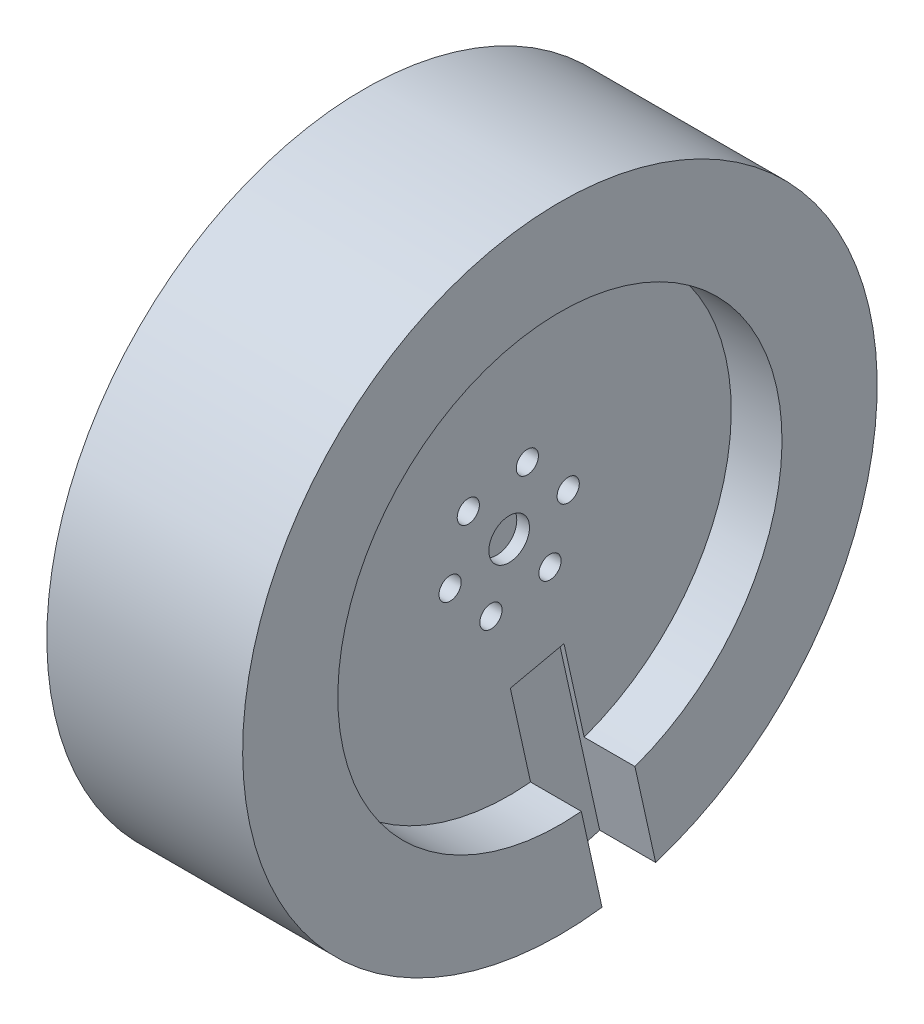
ISO-10303-21;
HEADER;
FILE_DESCRIPTION(('STEP AP214'),'2;1');
FILE_NAME('part.step','',(''),(''),'','','');
FILE_SCHEMA(('AUTOMOTIVE_DESIGN { 1 0 10303 214 1 1 1 1 }'));
ENDSEC;
DATA;
#1=APPLICATION_CONTEXT('core data for automotive mechanical design processes');
#2=APPLICATION_PROTOCOL_DEFINITION('international standard','automotive_design',2000,#1);
#3=PRODUCT_CONTEXT('',#1,'mechanical');
#4=PRODUCT('Part','Part','',(#3));
#5=PRODUCT_RELATED_PRODUCT_CATEGORY('part','',(#4));
#6=PRODUCT_DEFINITION_FORMATION('','',#4);
#7=PRODUCT_DEFINITION_CONTEXT('part definition',#1,'design');
#8=PRODUCT_DEFINITION('design','',#6,#7);
#9=PRODUCT_DEFINITION_SHAPE('','',#8);
#10=(LENGTH_UNIT() NAMED_UNIT(*) SI_UNIT(.MILLI.,.METRE.));
#11=(NAMED_UNIT(*) PLANE_ANGLE_UNIT() SI_UNIT($,.RADIAN.));
#12=(NAMED_UNIT(*) SI_UNIT($,.STERADIAN.) SOLID_ANGLE_UNIT());
#13=UNCERTAINTY_MEASURE_WITH_UNIT(LENGTH_MEASURE(1.E-05),#10,'distance_accuracy_value','');
#14=(GEOMETRIC_REPRESENTATION_CONTEXT(3) GLOBAL_UNCERTAINTY_ASSIGNED_CONTEXT((#13)) GLOBAL_UNIT_ASSIGNED_CONTEXT((#10,
#11,#12)) REPRESENTATION_CONTEXT('',''));
#15=CARTESIAN_POINT('',(0.,0.,0.));
#16=DIRECTION('',(0.,0.,1.));
#17=DIRECTION('',(1.,0.,0.));
#18=AXIS2_PLACEMENT_3D('',#15,#16,#17);
#19=CARTESIAN_POINT('',(30.,-9.0881194194578,2.86827220076371));
#20=DIRECTION('',(-1.,0.,0.));
#21=DIRECTION('',(0.,0.,1.));
#22=AXIS2_PLACEMENT_3D('',#19,#20,#21);
#23=CYLINDRICAL_SURFACE('',#22,1.75);
#24=CARTESIAN_POINT('',(22.86,-9.0881194194578,2.86827220076371));
#25=DIRECTION('',(1.,0.,0.));
#26=DIRECTION('',(0.,0.,-1.));
#27=AXIS2_PLACEMENT_3D('',#24,#25,#26);
#28=CIRCLE('',#27,1.75);
#29=CARTESIAN_POINT('',(22.86,-9.0881194194578,1.11827220076371));
#30=VERTEX_POINT('',#29);
#31=EDGE_CURVE('E145',#30,#30,#28,.T.);
#32=ORIENTED_EDGE('',*,*,#31,.T.);
#33=EDGE_LOOP('',(#32));
#34=FACE_BOUND('',#33,.T.);
#35=CARTESIAN_POINT('',(10.,-9.0881194194578,2.86827220076371));
#36=DIRECTION('',(-1.,0.,0.));
#37=DIRECTION('',(0.,0.,1.));
#38=AXIS2_PLACEMENT_3D('',#35,#36,#37);
#39=CIRCLE('',#38,1.75);
#40=CARTESIAN_POINT('',(10.,-9.0881194194578,4.61827220076371));
#41=VERTEX_POINT('',#40);
#42=EDGE_CURVE('E38',#41,#41,#39,.F.);
#43=ORIENTED_EDGE('',*,*,#42,.F.);
#44=EDGE_LOOP('',(#43));
#45=FACE_BOUND('',#44,.T.);
#46=ADVANCED_FACE('F34',(#34,#45),#23,.F.);
#47=CARTESIAN_POINT('',(30.,-2.06006311889883,9.30467839025899));
#48=DIRECTION('',(-1.,0.,0.));
#49=DIRECTION('',(0.,0.,1.));
#50=AXIS2_PLACEMENT_3D('',#47,#48,#49);
#51=CYLINDRICAL_SURFACE('',#50,1.75);
#52=CARTESIAN_POINT('',(22.86,-2.06006311889883,9.30467839025899));
#53=DIRECTION('',(1.,0.,0.));
#54=DIRECTION('',(0.,0.,-1.));
#55=AXIS2_PLACEMENT_3D('',#52,#53,#54);
#56=CIRCLE('',#55,1.75);
#57=CARTESIAN_POINT('',(22.86,-2.06006311889883,7.55467839025899));
#58=VERTEX_POINT('',#57);
#59=EDGE_CURVE('E149',#58,#58,#56,.T.);
#60=ORIENTED_EDGE('',*,*,#59,.T.);
#61=EDGE_LOOP('',(#60));
#62=FACE_BOUND('',#61,.T.);
#63=CARTESIAN_POINT('',(10.,-2.06006311889883,9.30467839025899));
#64=DIRECTION('',(-1.,0.,0.));
#65=DIRECTION('',(0.,0.,1.));
#66=AXIS2_PLACEMENT_3D('',#63,#64,#65);
#67=CIRCLE('',#66,1.75);
#68=CARTESIAN_POINT('',(10.,-2.06006311889883,11.054678390259));
#69=VERTEX_POINT('',#68);
#70=EDGE_CURVE('E176',#69,#69,#67,.F.);
#71=ORIENTED_EDGE('',*,*,#70,.F.);
#72=EDGE_LOOP('',(#71));
#73=FACE_BOUND('',#72,.T.);
#74=ADVANCED_FACE('F256',(#62,#73),#51,.F.);
#75=CARTESIAN_POINT('',(30.,7.02805630055897,6.43640618949528));
#76=DIRECTION('',(-1.,0.,0.));
#77=DIRECTION('',(0.,0.,1.));
#78=AXIS2_PLACEMENT_3D('',#75,#76,#77);
#79=CYLINDRICAL_SURFACE('',#78,1.75);
#80=CARTESIAN_POINT('',(22.86,7.02805630055897,6.43640618949528));
#81=DIRECTION('',(1.,0.,0.));
#82=DIRECTION('',(0.,0.,-1.));
#83=AXIS2_PLACEMENT_3D('',#80,#81,#82);
#84=CIRCLE('',#83,1.75);
#85=CARTESIAN_POINT('',(22.86,7.02805630055897,4.68640618949528));
#86=VERTEX_POINT('',#85);
#87=EDGE_CURVE('E152',#86,#86,#84,.T.);
#88=ORIENTED_EDGE('',*,*,#87,.T.);
#89=EDGE_LOOP('',(#88));
#90=FACE_BOUND('',#89,.T.);
#91=CARTESIAN_POINT('',(10.,7.02805630055897,6.43640618949528));
#92=DIRECTION('',(-1.,0.,0.));
#93=DIRECTION('',(0.,0.,1.));
#94=AXIS2_PLACEMENT_3D('',#91,#92,#93);
#95=CIRCLE('',#94,1.75);
#96=CARTESIAN_POINT('',(10.,7.02805630055897,8.18640618949528));
#97=VERTEX_POINT('',#96);
#98=EDGE_CURVE('E174',#97,#97,#95,.F.);
#99=ORIENTED_EDGE('',*,*,#98,.F.);
#100=EDGE_LOOP('',(#99));
#101=FACE_BOUND('',#100,.T.);
#102=ADVANCED_FACE('F262',(#90,#101),#79,.F.);
#103=CARTESIAN_POINT('',(30.,-7.02805630055897,-6.43640618949528));
#104=DIRECTION('',(-1.,0.,0.));
#105=DIRECTION('',(0.,0.,1.));
#106=AXIS2_PLACEMENT_3D('',#103,#104,#105);
#107=CYLINDRICAL_SURFACE('',#106,1.75);
#108=CARTESIAN_POINT('',(22.86,-7.02805630055897,-6.43640618949528));
#109=DIRECTION('',(1.,0.,0.));
#110=DIRECTION('',(0.,0.,-1.));
#111=AXIS2_PLACEMENT_3D('',#108,#109,#110);
#112=CIRCLE('',#111,1.75);
#113=CARTESIAN_POINT('',(22.86,-7.02805630055897,-8.18640618949529));
#114=VERTEX_POINT('',#113);
#115=EDGE_CURVE('E159',#114,#114,#112,.T.);
#116=ORIENTED_EDGE('',*,*,#115,.T.);
#117=EDGE_LOOP('',(#116));
#118=FACE_BOUND('',#117,.T.);
#119=CARTESIAN_POINT('',(10.,-7.02805630055897,-6.43640618949528));
#120=DIRECTION('',(-1.,0.,0.));
#121=DIRECTION('',(0.,0.,1.));
#122=AXIS2_PLACEMENT_3D('',#119,#120,#121);
#123=CIRCLE('',#122,1.75);
#124=CARTESIAN_POINT('',(10.,-7.02805630055897,-4.68640618949528));
#125=VERTEX_POINT('',#124);
#126=EDGE_CURVE('E170',#125,#125,#123,.F.);
#127=ORIENTED_EDGE('',*,*,#126,.F.);
#128=EDGE_LOOP('',(#127));
#129=FACE_BOUND('',#128,.T.);
#130=ADVANCED_FACE('F460',(#118,#129),#107,.F.);
#131=CARTESIAN_POINT('',(30.,2.06006311889883,-9.30467839025899));
#132=DIRECTION('',(-1.,0.,0.));
#133=DIRECTION('',(0.,0.,1.));
#134=AXIS2_PLACEMENT_3D('',#131,#132,#133);
#135=CYLINDRICAL_SURFACE('',#134,1.75);
#136=CARTESIAN_POINT('',(22.86,2.06006311889883,-9.30467839025899));
#137=DIRECTION('',(1.,0.,0.));
#138=DIRECTION('',(0.,0.,-1.));
#139=AXIS2_PLACEMENT_3D('',#136,#137,#138);
#140=CIRCLE('',#139,1.75);
#141=CARTESIAN_POINT('',(22.86,2.06006311889883,-11.054678390259));
#142=VERTEX_POINT('',#141);
#143=EDGE_CURVE('E148',#142,#142,#140,.T.);
#144=ORIENTED_EDGE('',*,*,#143,.T.);
#145=EDGE_LOOP('',(#144));
#146=FACE_BOUND('',#145,.T.);
#147=CARTESIAN_POINT('',(10.,2.06006311889883,-9.30467839025899));
#148=DIRECTION('',(-1.,0.,0.));
#149=DIRECTION('',(0.,0.,1.));
#150=AXIS2_PLACEMENT_3D('',#147,#148,#149);
#151=CIRCLE('',#150,1.75);
#152=CARTESIAN_POINT('',(10.,2.06006311889883,-7.55467839025899));
#153=VERTEX_POINT('',#152);
#154=EDGE_CURVE('E167',#153,#153,#151,.F.);
#155=ORIENTED_EDGE('',*,*,#154,.F.);
#156=EDGE_LOOP('',(#155));
#157=FACE_BOUND('',#156,.T.);
#158=ADVANCED_FACE('F251',(#146,#157),#135,.F.);
#159=CARTESIAN_POINT('',(30.,9.0881194194578,-2.86827220076371));
#160=DIRECTION('',(-1.,0.,0.));
#161=DIRECTION('',(0.,0.,1.));
#162=AXIS2_PLACEMENT_3D('',#159,#160,#161);
#163=CYLINDRICAL_SURFACE('',#162,1.75);
#164=CARTESIAN_POINT('',(22.86,9.0881194194578,-2.86827220076371));
#165=DIRECTION('',(1.,0.,0.));
#166=DIRECTION('',(0.,0.,-1.));
#167=AXIS2_PLACEMENT_3D('',#164,#165,#166);
#168=CIRCLE('',#167,1.75);
#169=CARTESIAN_POINT('',(22.86,9.0881194194578,-4.61827220076371));
#170=VERTEX_POINT('',#169);
#171=EDGE_CURVE('E156',#170,#170,#168,.T.);
#172=ORIENTED_EDGE('',*,*,#171,.T.);
#173=EDGE_LOOP('',(#172));
#174=FACE_BOUND('',#173,.T.);
#175=CARTESIAN_POINT('',(10.,9.0881194194578,-2.86827220076371));
#176=DIRECTION('',(-1.,0.,0.));
#177=DIRECTION('',(0.,0.,1.));
#178=AXIS2_PLACEMENT_3D('',#175,#176,#177);
#179=CIRCLE('',#178,1.75);
#180=CARTESIAN_POINT('',(10.,9.0881194194578,-1.11827220076371));
#181=VERTEX_POINT('',#180);
#182=EDGE_CURVE('E153',#181,#181,#179,.F.);
#183=ORIENTED_EDGE('',*,*,#182,.F.);
#184=EDGE_LOOP('',(#183));
#185=FACE_BOUND('',#184,.T.);
#186=ADVANCED_FACE('F243',(#174,#185),#163,.F.);
#187=CARTESIAN_POINT('',(30.86,0.,0.));
#188=DIRECTION('',(-1.,0.,0.));
#189=DIRECTION('',(0.,0.,1.));
#190=AXIS2_PLACEMENT_3D('',#187,#188,#189);
#191=CYLINDRICAL_SURFACE('',#190,50.);
#192=CARTESIAN_POINT('',(30.86,0.,0.));
#193=DIRECTION('',(1.,0.,0.));
#194=DIRECTION('',(0.,0.,-1.));
#195=AXIS2_PLACEMENT_3D('',#192,#193,#194);
#196=CIRCLE('',#195,50.);
#197=CARTESIAN_POINT('',(30.86,-47.6706593793764,-15.0833760920914));
#198=VERTEX_POINT('',#197);
#199=CARTESIAN_POINT('',(30.86,-49.5585145553134,-6.62975377150581));
#200=VERTEX_POINT('',#199);
#201=EDGE_CURVE('E136',#198,#200,#196,.T.);
#202=ORIENTED_EDGE('',*,*,#201,.F.);
#203=DIRECTION('',(-1.,0.,0.));
#204=VECTOR('',#203,1.);
#205=CARTESIAN_POINT('',(30.86,-47.6706593793764,-15.0833760920914));
#206=LINE('',#205,#204);
#207=CARTESIAN_POINT('',(22.0393776535559,-47.6706593793764,-15.0833760920914));
#208=VERTEX_POINT('',#207);
#209=EDGE_CURVE('E59',#198,#208,#206,.T.);
#210=ORIENTED_EDGE('',*,*,#209,.T.);
#211=CARTESIAN_POINT('',(22.0393776535559,0.,0.));
#212=DIRECTION('',(-1.,0.,0.));
#213=DIRECTION('',(0.,0.,1.));
#214=AXIS2_PLACEMENT_3D('',#211,#212,#213);
#215=CIRCLE('',#214,50.);
#216=CARTESIAN_POINT('',(22.0393776535559,-49.5585145553134,-6.62975377150581));
#217=VERTEX_POINT('',#216);
#218=EDGE_CURVE('E11',#208,#217,#215,.T.);
#219=ORIENTED_EDGE('',*,*,#218,.T.);
#220=DIRECTION('',(-1.,0.,0.));
#221=VECTOR('',#220,1.);
#222=CARTESIAN_POINT('',(30.86,-49.5585145553133,-6.62975377150581));
#223=LINE('',#222,#221);
#224=EDGE_CURVE('E97',#217,#200,#223,.F.);
#225=ORIENTED_EDGE('',*,*,#224,.T.);
#226=EDGE_LOOP('',(#202,#210,#219,#225));
#227=FACE_BOUND('',#226,.T.);
#228=CARTESIAN_POINT('',(0.,0.,0.));
#229=DIRECTION('',(1.,0.,0.));
#230=DIRECTION('',(0.,0.,-1.));
#231=AXIS2_PLACEMENT_3D('',#228,#229,#230);
#232=CIRCLE('',#231,50.);
#233=CARTESIAN_POINT('',(0.,0.,-50.));
#234=VERTEX_POINT('',#233);
#235=EDGE_CURVE('E133',#234,#234,#232,.T.);
#236=ORIENTED_EDGE('',*,*,#235,.T.);
#237=EDGE_LOOP('',(#236));
#238=FACE_BOUND('',#237,.T.);
#239=ADVANCED_FACE('F36',(#227,#238),#191,.T.);
#240=CARTESIAN_POINT('',(30.86,0.,0.));
#241=DIRECTION('',(1.,0.,0.));
#242=DIRECTION('',(0.,0.,-1.));
#243=AXIS2_PLACEMENT_3D('',#240,#241,#242);
#244=PLANE('',#243);
#245=DIRECTION('',(0.,0.976356599187723,0.216166119506698));
#246=VECTOR('',#245,1.);
#247=CARTESIAN_POINT('',(30.86,0.955880599829158,-4.31742186892429));
#248=LINE('',#247,#246);
#249=CARTESIAN_POINT('',(30.86,-32.9427672221426,-11.8226091768158));
#250=VERTEX_POINT('',#249);
#251=EDGE_CURVE('E126',#198,#250,#248,.T.);
#252=ORIENTED_EDGE('',*,*,#251,.F.);
#253=ORIENTED_EDGE('',*,*,#201,.T.);
#254=DIRECTION('',(0.,-0.976356599187723,-0.216166119506698));
#255=VECTOR('',#254,1.);
#256=CARTESIAN_POINT('',(30.86,-0.916515798543683,4.13962303718092));
#257=LINE('',#256,#255);
#258=CARTESIAN_POINT('',(30.86,-34.8373350230609,-3.37047303668425));
#259=VERTEX_POINT('',#258);
#260=EDGE_CURVE('E120',#259,#200,#257,.T.);
#261=ORIENTED_EDGE('',*,*,#260,.F.);
#262=CARTESIAN_POINT('',(30.86,0.,0.));
#263=DIRECTION('',(1.,0.,0.));
#264=DIRECTION('',(0.,0.,-1.));
#265=AXIS2_PLACEMENT_3D('',#262,#263,#264);
#266=CIRCLE('',#265,35.);
#267=EDGE_CURVE('E129',#250,#259,#266,.T.);
#268=ORIENTED_EDGE('',*,*,#267,.F.);
#269=EDGE_LOOP('',(#252,#253,#261,#268));
#270=FACE_BOUND('',#269,.T.);
#271=ADVANCED_FACE('F233',(#270),#244,.T.);
#272=CARTESIAN_POINT('',(0.,0.,0.));
#273=DIRECTION('',(1.,0.,0.));
#274=DIRECTION('',(0.,0.,-1.));
#275=AXIS2_PLACEMENT_3D('',#272,#273,#274);
#276=PLANE('',#275);
#277=CARTESIAN_POINT('',(0.,2.06006311889883,-9.30467839025899));
#278=DIRECTION('',(-1.,0.,0.));
#279=DIRECTION('',(0.,0.,1.));
#280=AXIS2_PLACEMENT_3D('',#277,#278,#279);
#281=CIRCLE('',#280,4.);
#282=CARTESIAN_POINT('',(0.,2.06006311889883,-5.30467839025899));
#283=VERTEX_POINT('',#282);
#284=EDGE_CURVE('E203',#283,#283,#281,.T.);
#285=ORIENTED_EDGE('',*,*,#284,.F.);
#286=EDGE_LOOP('',(#285));
#287=FACE_BOUND('',#286,.T.);
#288=CARTESIAN_POINT('',(0.,-7.02805630055897,-6.43640618949528));
#289=DIRECTION('',(-1.,0.,0.));
#290=DIRECTION('',(0.,0.,1.));
#291=AXIS2_PLACEMENT_3D('',#288,#289,#290);
#292=CIRCLE('',#291,4.);
#293=CARTESIAN_POINT('',(0.,-7.02805630055897,-2.43640618949528));
#294=VERTEX_POINT('',#293);
#295=EDGE_CURVE('E209',#294,#294,#292,.T.);
#296=ORIENTED_EDGE('',*,*,#295,.F.);
#297=EDGE_LOOP('',(#296));
#298=FACE_BOUND('',#297,.T.);
#299=CARTESIAN_POINT('',(0.,-9.0881194194578,2.86827220076371));
#300=DIRECTION('',(-1.,0.,0.));
#301=DIRECTION('',(0.,0.,1.));
#302=AXIS2_PLACEMENT_3D('',#299,#300,#301);
#303=CIRCLE('',#302,4.);
#304=CARTESIAN_POINT('',(0.,-9.0881194194578,6.86827220076371));
#305=VERTEX_POINT('',#304);
#306=EDGE_CURVE('E215',#305,#305,#303,.T.);
#307=ORIENTED_EDGE('',*,*,#306,.F.);
#308=EDGE_LOOP('',(#307));
#309=FACE_BOUND('',#308,.T.);
#310=CARTESIAN_POINT('',(0.,-2.06006311889883,9.30467839025899));
#311=DIRECTION('',(-1.,0.,0.));
#312=DIRECTION('',(0.,0.,1.));
#313=AXIS2_PLACEMENT_3D('',#310,#311,#312);
#314=CIRCLE('',#313,4.);
#315=CARTESIAN_POINT('',(0.,-2.06006311889883,13.304678390259));
#316=VERTEX_POINT('',#315);
#317=EDGE_CURVE('E191',#316,#316,#314,.T.);
#318=ORIENTED_EDGE('',*,*,#317,.F.);
#319=EDGE_LOOP('',(#318));
#320=FACE_BOUND('',#319,.T.);
#321=CARTESIAN_POINT('',(0.,7.02805630055897,6.43640618949528));
#322=DIRECTION('',(-1.,0.,0.));
#323=DIRECTION('',(0.,0.,1.));
#324=AXIS2_PLACEMENT_3D('',#321,#322,#323);
#325=CIRCLE('',#324,4.);
#326=CARTESIAN_POINT('',(0.,7.02805630055897,10.4364061894953));
#327=VERTEX_POINT('',#326);
#328=EDGE_CURVE('E198',#327,#327,#325,.T.);
#329=ORIENTED_EDGE('',*,*,#328,.F.);
#330=EDGE_LOOP('',(#329));
#331=FACE_BOUND('',#330,.T.);
#332=CARTESIAN_POINT('',(0.,9.0881194194578,-2.86827220076371));
#333=DIRECTION('',(-1.,0.,0.));
#334=DIRECTION('',(0.,0.,1.));
#335=AXIS2_PLACEMENT_3D('',#332,#333,#334);
#336=CIRCLE('',#335,4.);
#337=CARTESIAN_POINT('',(0.,9.0881194194578,1.13172779923629));
#338=VERTEX_POINT('',#337);
#339=EDGE_CURVE('E181',#338,#338,#336,.T.);
#340=ORIENTED_EDGE('',*,*,#339,.F.);
#341=EDGE_LOOP('',(#340));
#342=FACE_BOUND('',#341,.T.);
#343=ORIENTED_EDGE('',*,*,#235,.F.);
#344=EDGE_LOOP('',(#343));
#345=FACE_BOUND('',#344,.T.);
#346=ADVANCED_FACE('F229',(#287,#298,#309,#320,#331,#342,#345),#276,.F.);
#347=CARTESIAN_POINT('',(22.86,0.,0.));
#348=DIRECTION('',(1.,0.,0.));
#349=DIRECTION('',(0.,0.,-1.));
#350=AXIS2_PLACEMENT_3D('',#347,#348,#349);
#351=CYLINDRICAL_SURFACE('',#350,35.);
#352=CARTESIAN_POINT('',(22.86,0.,0.));
#353=DIRECTION('',(1.,0.,0.));
#354=DIRECTION('',(0.,0.,-1.));
#355=AXIS2_PLACEMENT_3D('',#352,#353,#354);
#356=CIRCLE('',#355,35.);
#357=CARTESIAN_POINT('',(22.86,-32.9427672221426,-11.8226091768158));
#358=VERTEX_POINT('',#357);
#359=CARTESIAN_POINT('',(22.86,-34.8373350230609,-3.37047303668425));
#360=VERTEX_POINT('',#359);
#361=EDGE_CURVE('E130',#358,#360,#356,.T.);
#362=ORIENTED_EDGE('',*,*,#361,.F.);
#363=DIRECTION('',(1.,0.,0.));
#364=VECTOR('',#363,1.);
#365=CARTESIAN_POINT('',(22.86,-32.9427672221426,-11.8226091768158));
#366=LINE('',#365,#364);
#367=EDGE_CURVE('E123',#358,#250,#366,.T.);
#368=ORIENTED_EDGE('',*,*,#367,.T.);
#369=ORIENTED_EDGE('',*,*,#267,.T.);
#370=DIRECTION('',(1.,0.,0.));
#371=VECTOR('',#370,1.);
#372=CARTESIAN_POINT('',(22.86,-34.8373350230609,-3.37047303668425));
#373=LINE('',#372,#371);
#374=EDGE_CURVE('E116',#259,#360,#373,.F.);
#375=ORIENTED_EDGE('',*,*,#374,.T.);
#376=EDGE_LOOP('',(#362,#368,#369,#375));
#377=FACE_BOUND('',#376,.T.);
#378=ADVANCED_FACE('F232',(#377),#351,.F.);
#379=CARTESIAN_POINT('',(22.86,0.,0.));
#380=DIRECTION('',(1.,0.,0.));
#381=DIRECTION('',(0.,0.,-1.));
#382=AXIS2_PLACEMENT_3D('',#379,#380,#381);
#383=PLANE('',#382);
#384=ORIENTED_EDGE('',*,*,#143,.F.);
#385=EDGE_LOOP('',(#384));
#386=FACE_BOUND('',#385,.T.);
#387=ORIENTED_EDGE('',*,*,#115,.F.);
#388=EDGE_LOOP('',(#387));
#389=FACE_BOUND('',#388,.T.);
#390=ORIENTED_EDGE('',*,*,#171,.F.);
#391=EDGE_LOOP('',(#390));
#392=FACE_BOUND('',#391,.T.);
#393=ORIENTED_EDGE('',*,*,#87,.F.);
#394=EDGE_LOOP('',(#393));
#395=FACE_BOUND('',#394,.T.);
#396=ORIENTED_EDGE('',*,*,#59,.F.);
#397=EDGE_LOOP('',(#396));
#398=FACE_BOUND('',#397,.T.);
#399=ORIENTED_EDGE('',*,*,#31,.F.);
#400=EDGE_LOOP('',(#399));
#401=FACE_BOUND('',#400,.T.);
#402=CARTESIAN_POINT('',(22.86,0.,0.));
#403=DIRECTION('',(1.,0.,0.));
#404=DIRECTION('',(0.,0.,-1.));
#405=AXIS2_PLACEMENT_3D('',#402,#403,#404);
#406=CIRCLE('',#405,3.2);
#407=CARTESIAN_POINT('',(22.86,0.,-3.2));
#408=VERTEX_POINT('',#407);
#409=EDGE_CURVE('E111',#408,#408,#406,.T.);
#410=ORIENTED_EDGE('',*,*,#409,.F.);
#411=EDGE_LOOP('',(#410));
#412=FACE_BOUND('',#411,.T.);
#413=DIRECTION('',(0.,0.976356599187723,0.216166119506698));
#414=VECTOR('',#413,1.);
#415=CARTESIAN_POINT('',(22.86,0.955880599829158,-4.31742186892429));
#416=LINE('',#415,#414);
#417=CARTESIAN_POINT('',(22.86,-18.5712513839253,-8.64074425905824));
#418=VERTEX_POINT('',#417);
#419=EDGE_CURVE('E43',#358,#418,#416,.T.);
#420=ORIENTED_EDGE('',*,*,#419,.F.);
#421=ORIENTED_EDGE('',*,*,#361,.T.);
#422=DIRECTION('',(0.,-0.976356599187723,-0.216166119506698));
#423=VECTOR('',#422,1.);
#424=CARTESIAN_POINT('',(22.86,-0.916515798543683,4.13962303718092));
#425=LINE('',#424,#423);
#426=CARTESIAN_POINT('',(22.86,-20.4436477822982,-0.183699352953034));
#427=VERTEX_POINT('',#426);
#428=EDGE_CURVE('E142',#427,#360,#425,.T.);
#429=ORIENTED_EDGE('',*,*,#428,.F.);
#430=DIRECTION('',(0.,-0.216166119506698,0.976356599187723));
#431=VECTOR('',#430,1.);
#432=CARTESIAN_POINT('',(22.86,-19.5271319837545,-4.32332239013395));
#433=LINE('',#432,#431);
#434=EDGE_CURVE('E105',#418,#427,#433,.T.);
#435=ORIENTED_EDGE('',*,*,#434,.F.);
#436=EDGE_LOOP('',(#420,#421,#429,#435));
#437=FACE_BOUND('',#436,.T.);
#438=ADVANCED_FACE('F286',(#386,#389,#392,#395,#398,#401,#412,#437),#383,.T.);
#439=CARTESIAN_POINT('',(22.0393776535559,-77.1526473351887,-21.6107114294601));
#440=DIRECTION('',(-1.,0.,0.));
#441=DIRECTION('',(0.,0.,1.));
#442=AXIS2_PLACEMENT_3D('',#439,#440,#441);
#443=PLANE('',#442);
#444=DIRECTION('',(0.,0.976356599187723,0.216166119506698));
#445=VECTOR('',#444,1.);
#446=CARTESIAN_POINT('',(22.0393776535559,-77.1526473351887,-21.6107114294601));
#447=LINE('',#446,#445);
#448=CARTESIAN_POINT('',(22.0393776535559,-18.5712513839253,-8.64074425905824));
#449=VERTEX_POINT('',#448);
#450=EDGE_CURVE('E100',#208,#449,#447,.T.);
#451=ORIENTED_EDGE('',*,*,#450,.T.);
#452=DIRECTION('',(0.,-0.216166119506698,0.976356599187723));
#453=VECTOR('',#452,1.);
#454=CARTESIAN_POINT('',(22.0393776535559,-18.5712513839253,-8.64074425905824));
#455=LINE('',#454,#453);
#456=CARTESIAN_POINT('',(22.0393776535559,-20.4436477822982,-0.183699352953034));
#457=VERTEX_POINT('',#456);
#458=EDGE_CURVE('E103',#449,#457,#455,.T.);
#459=ORIENTED_EDGE('',*,*,#458,.T.);
#460=DIRECTION('',(0.,0.976356599187723,0.216166119506698));
#461=VECTOR('',#460,1.);
#462=CARTESIAN_POINT('',(22.0393776535559,-79.0250437335615,-13.1536665233549));
#463=LINE('',#462,#461);
#464=EDGE_CURVE('E91',#217,#457,#463,.T.);
#465=ORIENTED_EDGE('',*,*,#464,.F.);
#466=ORIENTED_EDGE('',*,*,#218,.F.);
#467=EDGE_LOOP('',(#451,#459,#465,#466));
#468=FACE_BOUND('',#467,.T.);
#469=ADVANCED_FACE('F107',(#468),#443,.F.);
#470=CARTESIAN_POINT('',(22.0393776535559,-77.1526473351887,-21.6107114294601));
#471=DIRECTION('',(0.,0.216166119506698,-0.976356599187723));
#472=DIRECTION('',(0.,0.976356599187723,0.216166119506698));
#473=AXIS2_PLACEMENT_3D('',#470,#471,#472);
#474=PLANE('',#473);
#475=ORIENTED_EDGE('',*,*,#251,.T.);
#476=ORIENTED_EDGE('',*,*,#367,.F.);
#477=ORIENTED_EDGE('',*,*,#419,.T.);
#478=DIRECTION('',(-1.,0.,0.));
#479=VECTOR('',#478,1.);
#480=CARTESIAN_POINT('',(22.0393776535559,-18.5712513839253,-8.64074425905824));
#481=LINE('',#480,#479);
#482=EDGE_CURVE('E51',#418,#449,#481,.T.);
#483=ORIENTED_EDGE('',*,*,#482,.T.);
#484=ORIENTED_EDGE('',*,*,#450,.F.);
#485=ORIENTED_EDGE('',*,*,#209,.F.);
#486=EDGE_LOOP('',(#475,#476,#477,#483,#484,#485));
#487=FACE_BOUND('',#486,.T.);
#488=ADVANCED_FACE('F279',(#487),#474,.F.);
#489=CARTESIAN_POINT('',(22.0393776535559,-79.0250437335615,-13.1536665233549));
#490=DIRECTION('',(0.,-0.216166119506698,0.976356599187723));
#491=DIRECTION('',(0.,-0.976356599187723,-0.216166119506698));
#492=AXIS2_PLACEMENT_3D('',#489,#490,#491);
#493=PLANE('',#492);
#494=ORIENTED_EDGE('',*,*,#464,.T.);
#495=DIRECTION('',(1.,0.,0.));
#496=VECTOR('',#495,1.);
#497=CARTESIAN_POINT('',(22.0393776535559,-20.4436477822982,-0.183699352953034));
#498=LINE('',#497,#496);
#499=EDGE_CURVE('E94',#457,#427,#498,.T.);
#500=ORIENTED_EDGE('',*,*,#499,.T.);
#501=ORIENTED_EDGE('',*,*,#428,.T.);
#502=ORIENTED_EDGE('',*,*,#374,.F.);
#503=ORIENTED_EDGE('',*,*,#260,.T.);
#504=ORIENTED_EDGE('',*,*,#224,.F.);
#505=EDGE_LOOP('',(#494,#500,#501,#502,#503,#504));
#506=FACE_BOUND('',#505,.T.);
#507=ADVANCED_FACE('F93',(#506),#493,.F.);
#508=CARTESIAN_POINT('',(0.,-19.5271319837545,-4.32332239013395));
#509=DIRECTION('',(0.,0.976356599187723,0.216166119506698));
#510=DIRECTION('',(0.,-0.216166119506698,0.976356599187723));
#511=AXIS2_PLACEMENT_3D('',#508,#509,#510);
#512=PLANE('',#511);
#513=ORIENTED_EDGE('',*,*,#434,.T.);
#514=ORIENTED_EDGE('',*,*,#499,.F.);
#515=ORIENTED_EDGE('',*,*,#458,.F.);
#516=ORIENTED_EDGE('',*,*,#482,.F.);
#517=EDGE_LOOP('',(#513,#514,#515,#516));
#518=FACE_BOUND('',#517,.T.);
#519=ADVANCED_FACE('F102',(#518),#512,.F.);
#520=CARTESIAN_POINT('',(20.86,0.,0.));
#521=DIRECTION('',(1.,0.,0.));
#522=DIRECTION('',(0.,0.,-1.));
#523=AXIS2_PLACEMENT_3D('',#520,#521,#522);
#524=CYLINDRICAL_SURFACE('',#523,3.2);
#525=CARTESIAN_POINT('',(20.86,0.,0.));
#526=DIRECTION('',(1.,0.,0.));
#527=DIRECTION('',(0.,0.,-1.));
#528=AXIS2_PLACEMENT_3D('',#525,#526,#527);
#529=CIRCLE('',#528,3.2);
#530=CARTESIAN_POINT('',(20.86,0.,-3.2));
#531=VERTEX_POINT('',#530);
#532=EDGE_CURVE('E108',#531,#531,#529,.T.);
#533=ORIENTED_EDGE('',*,*,#532,.F.);
#534=EDGE_LOOP('',(#533));
#535=FACE_BOUND('',#534,.T.);
#536=ORIENTED_EDGE('',*,*,#409,.T.);
#537=EDGE_LOOP('',(#536));
#538=FACE_BOUND('',#537,.T.);
#539=ADVANCED_FACE('F272',(#535,#538),#524,.F.);
#540=CARTESIAN_POINT('',(20.86,0.,0.));
#541=DIRECTION('',(1.,0.,0.));
#542=DIRECTION('',(0.,0.,-1.));
#543=AXIS2_PLACEMENT_3D('',#540,#541,#542);
#544=PLANE('',#543);
#545=ORIENTED_EDGE('',*,*,#532,.T.);
#546=EDGE_LOOP('',(#545));
#547=FACE_BOUND('',#546,.T.);
#548=ADVANCED_FACE('F268',(#547),#544,.T.);
#549=CARTESIAN_POINT('',(10.,9.0881194194578,-2.86827220076371));
#550=DIRECTION('',(-1.,0.,0.));
#551=DIRECTION('',(0.,0.,1.));
#552=AXIS2_PLACEMENT_3D('',#549,#550,#551);
#553=PLANE('',#552);
#554=CARTESIAN_POINT('',(10.,9.0881194194578,-2.86827220076371));
#555=DIRECTION('',(-1.,0.,0.));
#556=DIRECTION('',(0.,0.,1.));
#557=AXIS2_PLACEMENT_3D('',#554,#555,#556);
#558=CIRCLE('',#557,4.);
#559=CARTESIAN_POINT('',(10.,9.0881194194578,1.13172779923629));
#560=VERTEX_POINT('',#559);
#561=EDGE_CURVE('E166',#560,#560,#558,.T.);
#562=ORIENTED_EDGE('',*,*,#561,.T.);
#563=EDGE_LOOP('',(#562));
#564=FACE_BOUND('',#563,.T.);
#565=ORIENTED_EDGE('',*,*,#182,.T.);
#566=EDGE_LOOP('',(#565));
#567=FACE_BOUND('',#566,.T.);
#568=ADVANCED_FACE('F271',(#564,#567),#553,.T.);
#569=CARTESIAN_POINT('',(10.,9.0881194194578,-2.86827220076371));
#570=DIRECTION('',(-1.,0.,0.));
#571=DIRECTION('',(0.,0.,1.));
#572=AXIS2_PLACEMENT_3D('',#569,#570,#571);
#573=CYLINDRICAL_SURFACE('',#572,4.);
#574=ORIENTED_EDGE('',*,*,#561,.F.);
#575=EDGE_LOOP('',(#574));
#576=FACE_BOUND('',#575,.T.);
#577=ORIENTED_EDGE('',*,*,#339,.T.);
#578=EDGE_LOOP('',(#577));
#579=FACE_BOUND('',#578,.T.);
#580=ADVANCED_FACE('F336',(#576,#579),#573,.F.);
#581=CARTESIAN_POINT('',(10.,2.06006311889883,-9.30467839025899));
#582=DIRECTION('',(-1.,0.,0.));
#583=DIRECTION('',(0.,0.,1.));
#584=AXIS2_PLACEMENT_3D('',#581,#582,#583);
#585=PLANE('',#584);
#586=CARTESIAN_POINT('',(10.,2.06006311889883,-9.30467839025899));
#587=DIRECTION('',(-1.,0.,0.));
#588=DIRECTION('',(0.,0.,1.));
#589=AXIS2_PLACEMENT_3D('',#586,#587,#588);
#590=CIRCLE('',#589,4.);
#591=CARTESIAN_POINT('',(10.,2.06006311889883,-5.30467839025899));
#592=VERTEX_POINT('',#591);
#593=EDGE_CURVE('E206',#592,#592,#590,.T.);
#594=ORIENTED_EDGE('',*,*,#593,.T.);
#595=EDGE_LOOP('',(#594));
#596=FACE_BOUND('',#595,.T.);
#597=ORIENTED_EDGE('',*,*,#154,.T.);
#598=EDGE_LOOP('',(#597));
#599=FACE_BOUND('',#598,.T.);
#600=ADVANCED_FACE('F344',(#596,#599),#585,.T.);
#601=CARTESIAN_POINT('',(10.,2.06006311889883,-9.30467839025899));
#602=DIRECTION('',(-1.,0.,0.));
#603=DIRECTION('',(0.,0.,1.));
#604=AXIS2_PLACEMENT_3D('',#601,#602,#603);
#605=CYLINDRICAL_SURFACE('',#604,4.);
#606=ORIENTED_EDGE('',*,*,#593,.F.);
#607=EDGE_LOOP('',(#606));
#608=FACE_BOUND('',#607,.T.);
#609=ORIENTED_EDGE('',*,*,#284,.T.);
#610=EDGE_LOOP('',(#609));
#611=FACE_BOUND('',#610,.T.);
#612=ADVANCED_FACE('F352',(#608,#611),#605,.F.);
#613=CARTESIAN_POINT('',(10.,-7.02805630055897,-6.43640618949528));
#614=DIRECTION('',(-1.,0.,0.));
#615=DIRECTION('',(0.,0.,1.));
#616=AXIS2_PLACEMENT_3D('',#613,#614,#615);
#617=PLANE('',#616);
#618=CARTESIAN_POINT('',(10.,-7.02805630055897,-6.43640618949528));
#619=DIRECTION('',(-1.,0.,0.));
#620=DIRECTION('',(0.,0.,1.));
#621=AXIS2_PLACEMENT_3D('',#618,#619,#620);
#622=CIRCLE('',#621,4.);
#623=CARTESIAN_POINT('',(10.,-7.02805630055897,-2.43640618949528));
#624=VERTEX_POINT('',#623);
#625=EDGE_CURVE('E212',#624,#624,#622,.T.);
#626=ORIENTED_EDGE('',*,*,#625,.T.);
#627=EDGE_LOOP('',(#626));
#628=FACE_BOUND('',#627,.T.);
#629=ORIENTED_EDGE('',*,*,#126,.T.);
#630=EDGE_LOOP('',(#629));
#631=FACE_BOUND('',#630,.T.);
#632=ADVANCED_FACE('F360',(#628,#631),#617,.T.);
#633=CARTESIAN_POINT('',(10.,-7.02805630055897,-6.43640618949528));
#634=DIRECTION('',(-1.,0.,0.));
#635=DIRECTION('',(0.,0.,1.));
#636=AXIS2_PLACEMENT_3D('',#633,#634,#635);
#637=CYLINDRICAL_SURFACE('',#636,4.);
#638=ORIENTED_EDGE('',*,*,#625,.F.);
#639=EDGE_LOOP('',(#638));
#640=FACE_BOUND('',#639,.T.);
#641=ORIENTED_EDGE('',*,*,#295,.T.);
#642=EDGE_LOOP('',(#641));
#643=FACE_BOUND('',#642,.T.);
#644=ADVANCED_FACE('F368',(#640,#643),#637,.F.);
#645=CARTESIAN_POINT('',(10.,7.02805630055897,6.43640618949528));
#646=DIRECTION('',(-1.,0.,0.));
#647=DIRECTION('',(0.,0.,1.));
#648=AXIS2_PLACEMENT_3D('',#645,#646,#647);
#649=PLANE('',#648);
#650=CARTESIAN_POINT('',(10.,7.02805630055897,6.43640618949528));
#651=DIRECTION('',(-1.,0.,0.));
#652=DIRECTION('',(0.,0.,1.));
#653=AXIS2_PLACEMENT_3D('',#650,#651,#652);
#654=CIRCLE('',#653,4.);
#655=CARTESIAN_POINT('',(10.,7.02805630055897,10.4364061894953));
#656=VERTEX_POINT('',#655);
#657=EDGE_CURVE('E171',#656,#656,#654,.T.);
#658=ORIENTED_EDGE('',*,*,#657,.T.);
#659=EDGE_LOOP('',(#658));
#660=FACE_BOUND('',#659,.T.);
#661=ORIENTED_EDGE('',*,*,#98,.T.);
#662=EDGE_LOOP('',(#661));
#663=FACE_BOUND('',#662,.T.);
#664=ADVANCED_FACE('F376',(#660,#663),#649,.T.);
#665=CARTESIAN_POINT('',(10.,7.02805630055897,6.43640618949528));
#666=DIRECTION('',(-1.,0.,0.));
#667=DIRECTION('',(0.,0.,1.));
#668=AXIS2_PLACEMENT_3D('',#665,#666,#667);
#669=CYLINDRICAL_SURFACE('',#668,4.);
#670=ORIENTED_EDGE('',*,*,#657,.F.);
#671=EDGE_LOOP('',(#670));
#672=FACE_BOUND('',#671,.T.);
#673=ORIENTED_EDGE('',*,*,#328,.T.);
#674=EDGE_LOOP('',(#673));
#675=FACE_BOUND('',#674,.T.);
#676=ADVANCED_FACE('F384',(#672,#675),#669,.F.);
#677=CARTESIAN_POINT('',(10.,-2.06006311889883,9.30467839025899));
#678=DIRECTION('',(-1.,0.,0.));
#679=DIRECTION('',(0.,0.,1.));
#680=AXIS2_PLACEMENT_3D('',#677,#678,#679);
#681=PLANE('',#680);
#682=CARTESIAN_POINT('',(10.,-2.06006311889883,9.30467839025899));
#683=DIRECTION('',(-1.,0.,0.));
#684=DIRECTION('',(0.,0.,1.));
#685=AXIS2_PLACEMENT_3D('',#682,#683,#684);
#686=CIRCLE('',#685,4.);
#687=CARTESIAN_POINT('',(10.,-2.06006311889883,13.304678390259));
#688=VERTEX_POINT('',#687);
#689=EDGE_CURVE('E194',#688,#688,#686,.T.);
#690=ORIENTED_EDGE('',*,*,#689,.T.);
#691=EDGE_LOOP('',(#690));
#692=FACE_BOUND('',#691,.T.);
#693=ORIENTED_EDGE('',*,*,#70,.T.);
#694=EDGE_LOOP('',(#693));
#695=FACE_BOUND('',#694,.T.);
#696=ADVANCED_FACE('F392',(#692,#695),#681,.T.);
#697=CARTESIAN_POINT('',(10.,-2.06006311889883,9.30467839025899));
#698=DIRECTION('',(-1.,0.,0.));
#699=DIRECTION('',(0.,0.,1.));
#700=AXIS2_PLACEMENT_3D('',#697,#698,#699);
#701=CYLINDRICAL_SURFACE('',#700,4.);
#702=ORIENTED_EDGE('',*,*,#689,.F.);
#703=EDGE_LOOP('',(#702));
#704=FACE_BOUND('',#703,.T.);
#705=ORIENTED_EDGE('',*,*,#317,.T.);
#706=EDGE_LOOP('',(#705));
#707=FACE_BOUND('',#706,.T.);
#708=ADVANCED_FACE('F400',(#704,#707),#701,.F.);
#709=CARTESIAN_POINT('',(10.,-9.0881194194578,2.86827220076371));
#710=DIRECTION('',(-1.,0.,0.));
#711=DIRECTION('',(0.,0.,1.));
#712=AXIS2_PLACEMENT_3D('',#709,#710,#711);
#713=PLANE('',#712);
#714=CARTESIAN_POINT('',(10.,-9.0881194194578,2.86827220076371));
#715=DIRECTION('',(-1.,0.,0.));
#716=DIRECTION('',(0.,0.,1.));
#717=AXIS2_PLACEMENT_3D('',#714,#715,#716);
#718=CIRCLE('',#717,4.);
#719=CARTESIAN_POINT('',(10.,-9.0881194194578,6.86827220076371));
#720=VERTEX_POINT('',#719);
#721=EDGE_CURVE('E195',#720,#720,#718,.T.);
#722=ORIENTED_EDGE('',*,*,#721,.T.);
#723=EDGE_LOOP('',(#722));
#724=FACE_BOUND('',#723,.T.);
#725=ORIENTED_EDGE('',*,*,#42,.T.);
#726=EDGE_LOOP('',(#725));
#727=FACE_BOUND('',#726,.T.);
#728=ADVANCED_FACE('F221',(#724,#727),#713,.T.);
#729=CARTESIAN_POINT('',(10.,-9.0881194194578,2.86827220076371));
#730=DIRECTION('',(-1.,0.,0.));
#731=DIRECTION('',(0.,0.,1.));
#732=AXIS2_PLACEMENT_3D('',#729,#730,#731);
#733=CYLINDRICAL_SURFACE('',#732,4.);
#734=ORIENTED_EDGE('',*,*,#721,.F.);
#735=EDGE_LOOP('',(#734));
#736=FACE_BOUND('',#735,.T.);
#737=ORIENTED_EDGE('',*,*,#306,.T.);
#738=EDGE_LOOP('',(#737));
#739=FACE_BOUND('',#738,.T.);
#740=ADVANCED_FACE('F223',(#736,#739),#733,.F.);
#741=CLOSED_SHELL('',(#46,#74,#102,#130,#158,#186,#239,#271,#346,#378,#438,#469,#488,#507,#519,
#539,#548,#568,#580,#600,#612,#632,#644,#664,#676,#696,#708,#728,#740));
#742=MANIFOLD_SOLID_BREP('B2',#741);
#743=ADVANCED_BREP_SHAPE_REPRESENTATION('',(#18,#742),#14);
#744=SHAPE_DEFINITION_REPRESENTATION(#9,#743);
ENDSEC;
END-ISO-10303-21;
